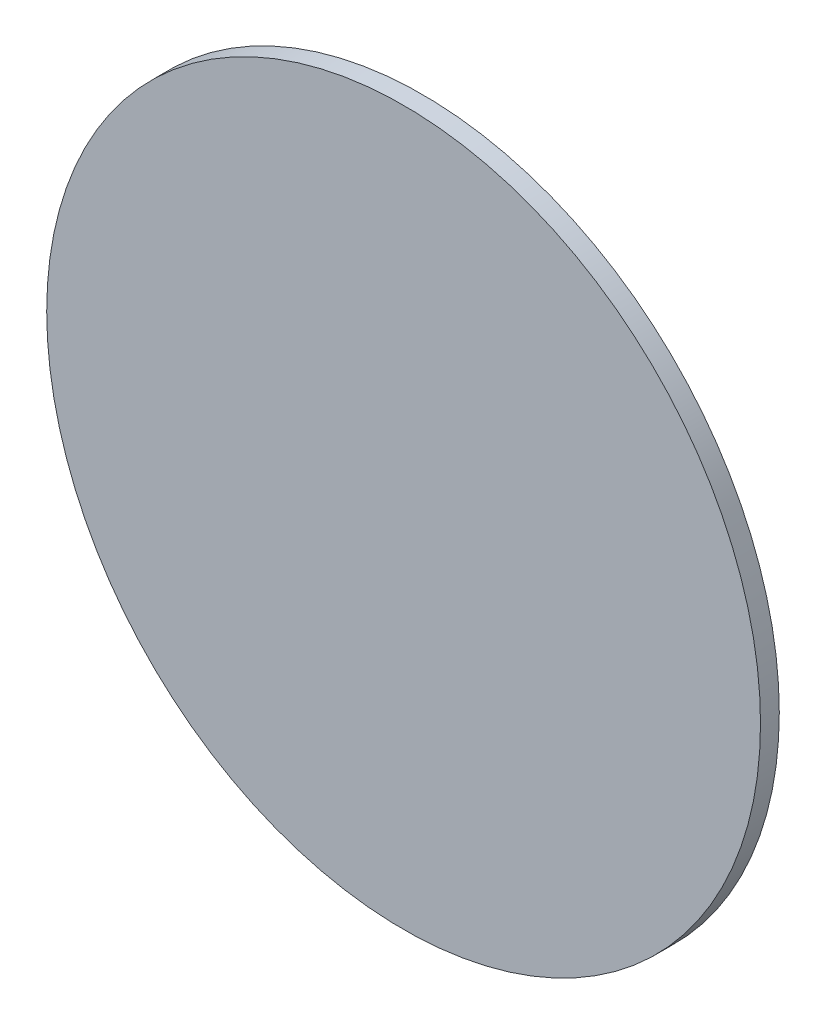
ISO-10303-21;
HEADER;
FILE_DESCRIPTION(('STEP AP214'),'2;1');
FILE_NAME('part.step','',(''),(''),'','','');
FILE_SCHEMA(('AUTOMOTIVE_DESIGN { 1 0 10303 214 1 1 1 1 }'));
ENDSEC;
DATA;
#1=APPLICATION_CONTEXT('core data for automotive mechanical design processes');
#2=APPLICATION_PROTOCOL_DEFINITION('international standard','automotive_design',2000,#1);
#3=PRODUCT_CONTEXT('',#1,'mechanical');
#4=PRODUCT('Part','Part','',(#3));
#5=PRODUCT_RELATED_PRODUCT_CATEGORY('part','',(#4));
#6=PRODUCT_DEFINITION_FORMATION('','',#4);
#7=PRODUCT_DEFINITION_CONTEXT('part definition',#1,'design');
#8=PRODUCT_DEFINITION('design','',#6,#7);
#9=PRODUCT_DEFINITION_SHAPE('','',#8);
#10=(LENGTH_UNIT() NAMED_UNIT(*) SI_UNIT(.MILLI.,.METRE.));
#11=(NAMED_UNIT(*) PLANE_ANGLE_UNIT() SI_UNIT($,.RADIAN.));
#12=(NAMED_UNIT(*) SI_UNIT($,.STERADIAN.) SOLID_ANGLE_UNIT());
#13=UNCERTAINTY_MEASURE_WITH_UNIT(LENGTH_MEASURE(1.E-05),#10,'distance_accuracy_value','');
#14=(GEOMETRIC_REPRESENTATION_CONTEXT(3) GLOBAL_UNCERTAINTY_ASSIGNED_CONTEXT((#13)) GLOBAL_UNIT_ASSIGNED_CONTEXT((#10,
#11,#12)) REPRESENTATION_CONTEXT('',''));
#15=CARTESIAN_POINT('',(0.,0.,0.));
#16=DIRECTION('',(0.,0.,1.));
#17=DIRECTION('',(1.,0.,0.));
#18=AXIS2_PLACEMENT_3D('',#15,#16,#17);
#19=CARTESIAN_POINT('',(0.,0.,0.4));
#20=DIRECTION('',(0.,0.,-1.));
#21=DIRECTION('',(-1.,0.,0.));
#22=AXIS2_PLACEMENT_3D('',#19,#20,#21);
#23=CYLINDRICAL_SURFACE('',#22,7.6);
#24=CARTESIAN_POINT('',(0.,0.,0.4));
#25=DIRECTION('',(0.,0.,1.));
#26=DIRECTION('',(1.,0.,0.));
#27=AXIS2_PLACEMENT_3D('',#24,#25,#26);
#28=CIRCLE('',#27,7.6);
#29=CARTESIAN_POINT('',(7.6,0.,0.4));
#30=VERTEX_POINT('',#29);
#31=EDGE_CURVE('E10',#30,#30,#28,.T.);
#32=ORIENTED_EDGE('',*,*,#31,.F.);
#33=EDGE_LOOP('',(#32));
#34=FACE_BOUND('',#33,.T.);
#35=CARTESIAN_POINT('',(0.,0.,0.));
#36=DIRECTION('',(0.,0.,1.));
#37=DIRECTION('',(1.,0.,0.));
#38=AXIS2_PLACEMENT_3D('',#35,#36,#37);
#39=CIRCLE('',#38,7.6);
#40=CARTESIAN_POINT('',(7.6,0.,0.));
#41=VERTEX_POINT('',#40);
#42=EDGE_CURVE('E34',#41,#41,#39,.T.);
#43=ORIENTED_EDGE('',*,*,#42,.T.);
#44=EDGE_LOOP('',(#43));
#45=FACE_BOUND('',#44,.T.);
#46=ADVANCED_FACE('F31',(#34,#45),#23,.T.);
#47=CARTESIAN_POINT('',(0.,0.,0.4));
#48=DIRECTION('',(0.,0.,1.));
#49=DIRECTION('',(1.,0.,0.));
#50=AXIS2_PLACEMENT_3D('',#47,#48,#49);
#51=PLANE('',#50);
#52=ORIENTED_EDGE('',*,*,#31,.T.);
#53=EDGE_LOOP('',(#52));
#54=FACE_BOUND('',#53,.T.);
#55=ADVANCED_FACE('F46',(#54),#51,.T.);
#56=CARTESIAN_POINT('',(0.,0.,0.));
#57=DIRECTION('',(0.,0.,1.));
#58=DIRECTION('',(1.,0.,0.));
#59=AXIS2_PLACEMENT_3D('',#56,#57,#58);
#60=PLANE('',#59);
#61=ORIENTED_EDGE('',*,*,#42,.F.);
#62=EDGE_LOOP('',(#61));
#63=FACE_BOUND('',#62,.T.);
#64=ADVANCED_FACE('F44',(#63),#60,.F.);
#65=CLOSED_SHELL('',(#46,#55,#64));
#66=MANIFOLD_SOLID_BREP('B2',#65);
#67=ADVANCED_BREP_SHAPE_REPRESENTATION('',(#18,#66),#14);
#68=SHAPE_DEFINITION_REPRESENTATION(#9,#67);
ENDSEC;
END-ISO-10303-21;
